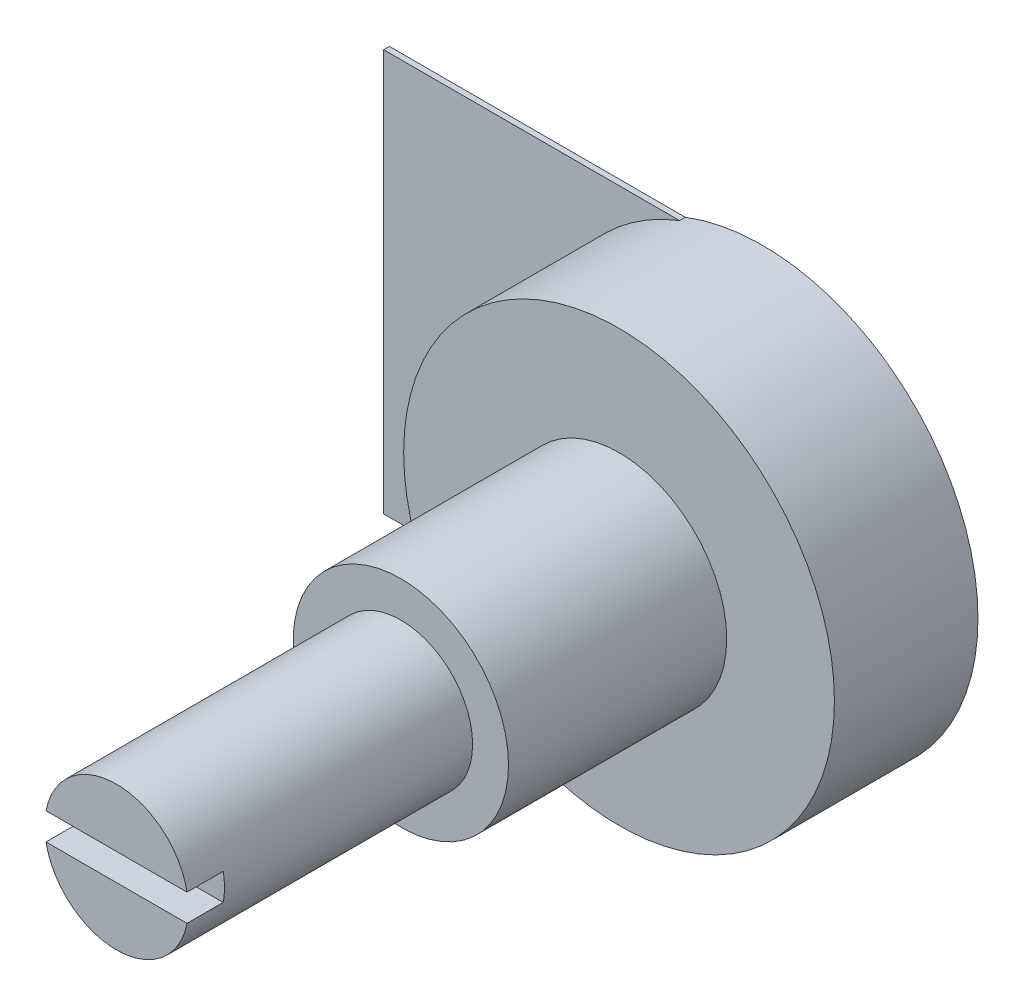
ISO-10303-21;
HEADER;
FILE_DESCRIPTION(('STEP AP214'),'2;1');
FILE_NAME('part.step','',(''),(''),'','','');
FILE_SCHEMA(('AUTOMOTIVE_DESIGN { 1 0 10303 214 1 1 1 1 }'));
ENDSEC;
DATA;
#1=APPLICATION_CONTEXT('core data for automotive mechanical design processes');
#2=APPLICATION_PROTOCOL_DEFINITION('international standard','automotive_design',2000,#1);
#3=PRODUCT_CONTEXT('',#1,'mechanical');
#4=PRODUCT('Part','Part','',(#3));
#5=PRODUCT_RELATED_PRODUCT_CATEGORY('part','',(#4));
#6=PRODUCT_DEFINITION_FORMATION('','',#4);
#7=PRODUCT_DEFINITION_CONTEXT('part definition',#1,'design');
#8=PRODUCT_DEFINITION('design','',#6,#7);
#9=PRODUCT_DEFINITION_SHAPE('','',#8);
#10=(LENGTH_UNIT() NAMED_UNIT(*) SI_UNIT(.MILLI.,.METRE.));
#11=(NAMED_UNIT(*) PLANE_ANGLE_UNIT() SI_UNIT($,.RADIAN.));
#12=(NAMED_UNIT(*) SI_UNIT($,.STERADIAN.) SOLID_ANGLE_UNIT());
#13=UNCERTAINTY_MEASURE_WITH_UNIT(LENGTH_MEASURE(1.E-05),#10,'distance_accuracy_value','');
#14=(GEOMETRIC_REPRESENTATION_CONTEXT(3) GLOBAL_UNCERTAINTY_ASSIGNED_CONTEXT((#13)) GLOBAL_UNIT_ASSIGNED_CONTEXT((#10,
#11,#12)) REPRESENTATION_CONTEXT('',''));
#15=CARTESIAN_POINT('',(0.,0.,0.));
#16=DIRECTION('',(0.,0.,1.));
#17=DIRECTION('',(1.,0.,0.));
#18=AXIS2_PLACEMENT_3D('',#15,#16,#17);
#19=CARTESIAN_POINT('',(-16.51,-8.89,0.));
#20=DIRECTION('',(0.,-1.,0.));
#21=DIRECTION('',(-1.,0.,0.));
#22=AXIS2_PLACEMENT_3D('',#19,#20,#21);
#23=PLANE('',#22);
#24=DIRECTION('',(0.,0.,-1.));
#25=VECTOR('',#24,1.);
#26=CARTESIAN_POINT('',(-3.41957965253042,-8.89,0.));
#27=LINE('',#26,#25);
#28=CARTESIAN_POINT('',(-3.41957965253042,-8.89,0.254));
#29=VERTEX_POINT('',#28);
#30=CARTESIAN_POINT('',(-3.41957965253042,-8.89,0.));
#31=VERTEX_POINT('',#30);
#32=EDGE_CURVE('E41',#29,#31,#27,.T.);
#33=ORIENTED_EDGE('',*,*,#32,.F.);
#34=DIRECTION('',(1.,0.,0.));
#35=VECTOR('',#34,1.);
#36=CARTESIAN_POINT('',(-3.41957965253042,-8.89,0.254));
#37=LINE('',#36,#35);
#38=CARTESIAN_POINT('',(-16.51,-8.89,0.254));
#39=VERTEX_POINT('',#38);
#40=EDGE_CURVE('E129',#39,#29,#37,.T.);
#41=ORIENTED_EDGE('',*,*,#40,.F.);
#42=DIRECTION('',(0.,0.,1.));
#43=VECTOR('',#42,1.);
#44=CARTESIAN_POINT('',(-16.51,-8.89,0.));
#45=LINE('',#44,#43);
#46=CARTESIAN_POINT('',(-16.51,-8.89,0.));
#47=VERTEX_POINT('',#46);
#48=EDGE_CURVE('E126',#47,#39,#45,.T.);
#49=ORIENTED_EDGE('',*,*,#48,.F.);
#50=DIRECTION('',(-1.,0.,0.));
#51=VECTOR('',#50,1.);
#52=CARTESIAN_POINT('',(0.,-8.89,0.));
#53=LINE('',#52,#51);
#54=EDGE_CURVE('E163',#31,#47,#53,.T.);
#55=ORIENTED_EDGE('',*,*,#54,.F.);
#56=EDGE_LOOP('',(#33,#41,#49,#55));
#57=FACE_BOUND('',#56,.T.);
#58=ADVANCED_FACE('F16',(#57),#23,.T.);
#59=CARTESIAN_POINT('',(-8.255,0.,0.254));
#60=DIRECTION('',(0.,0.,1.));
#61=DIRECTION('',(1.,0.,0.));
#62=AXIS2_PLACEMENT_3D('',#59,#60,#61);
#63=PLANE('',#62);
#64=CARTESIAN_POINT('',(0.,0.,0.254));
#65=DIRECTION('',(0.,0.,1.));
#66=DIRECTION('',(-1.,0.,0.));
#67=AXIS2_PLACEMENT_3D('',#64,#65,#66);
#68=CIRCLE('',#67,9.525);
#69=CARTESIAN_POINT('',(-3.41957965253042,8.89,0.254));
#70=VERTEX_POINT('',#69);
#71=EDGE_CURVE('E134',#70,#29,#68,.T.);
#72=ORIENTED_EDGE('',*,*,#71,.F.);
#73=DIRECTION('',(-1.,0.,0.));
#74=VECTOR('',#73,1.);
#75=CARTESIAN_POINT('',(-3.41957965253042,8.89,0.254));
#76=LINE('',#75,#74);
#77=CARTESIAN_POINT('',(-16.51,8.89,0.254));
#78=VERTEX_POINT('',#77);
#79=EDGE_CURVE('E10',#70,#78,#76,.T.);
#80=ORIENTED_EDGE('',*,*,#79,.T.);
#81=DIRECTION('',(0.,-1.,0.));
#82=VECTOR('',#81,1.);
#83=CARTESIAN_POINT('',(-16.51,-8.89,0.254));
#84=LINE('',#83,#82);
#85=EDGE_CURVE('E27',#78,#39,#84,.T.);
#86=ORIENTED_EDGE('',*,*,#85,.T.);
#87=ORIENTED_EDGE('',*,*,#40,.T.);
#88=EDGE_LOOP('',(#72,#80,#86,#87));
#89=FACE_BOUND('',#88,.T.);
#90=ADVANCED_FACE('F132',(#89),#63,.T.);
#91=CARTESIAN_POINT('',(0.,8.89,0.));
#92=DIRECTION('',(0.,1.,0.));
#93=DIRECTION('',(1.,0.,0.));
#94=AXIS2_PLACEMENT_3D('',#91,#92,#93);
#95=PLANE('',#94);
#96=DIRECTION('',(0.,0.,1.));
#97=VECTOR('',#96,1.);
#98=CARTESIAN_POINT('',(-3.41957965253042,8.89,0.));
#99=LINE('',#98,#97);
#100=CARTESIAN_POINT('',(-3.41957965253042,8.89,0.));
#101=VERTEX_POINT('',#100);
#102=EDGE_CURVE('E189',#101,#70,#99,.T.);
#103=ORIENTED_EDGE('',*,*,#102,.F.);
#104=DIRECTION('',(1.,0.,0.));
#105=VECTOR('',#104,1.);
#106=CARTESIAN_POINT('',(-16.51,8.89,0.));
#107=LINE('',#106,#105);
#108=CARTESIAN_POINT('',(-16.51,8.89,0.));
#109=VERTEX_POINT('',#108);
#110=EDGE_CURVE('E139',#109,#101,#107,.T.);
#111=ORIENTED_EDGE('',*,*,#110,.F.);
#112=DIRECTION('',(0.,0.,1.));
#113=VECTOR('',#112,1.);
#114=CARTESIAN_POINT('',(-16.51,8.89,0.));
#115=LINE('',#114,#113);
#116=EDGE_CURVE('E123',#109,#78,#115,.T.);
#117=ORIENTED_EDGE('',*,*,#116,.T.);
#118=ORIENTED_EDGE('',*,*,#79,.F.);
#119=EDGE_LOOP('',(#103,#111,#117,#118));
#120=FACE_BOUND('',#119,.T.);
#121=ADVANCED_FACE('F138',(#120),#95,.T.);
#122=CARTESIAN_POINT('',(-16.51,8.89,0.));
#123=DIRECTION('',(-1.,0.,0.));
#124=DIRECTION('',(0.,0.,1.));
#125=AXIS2_PLACEMENT_3D('',#122,#123,#124);
#126=PLANE('',#125);
#127=DIRECTION('',(0.,1.,0.));
#128=VECTOR('',#127,1.);
#129=CARTESIAN_POINT('',(-16.51,-8.89,0.));
#130=LINE('',#129,#128);
#131=EDGE_CURVE('E166',#47,#109,#130,.T.);
#132=ORIENTED_EDGE('',*,*,#131,.F.);
#133=ORIENTED_EDGE('',*,*,#48,.T.);
#134=ORIENTED_EDGE('',*,*,#85,.F.);
#135=ORIENTED_EDGE('',*,*,#116,.F.);
#136=EDGE_LOOP('',(#132,#133,#134,#135));
#137=FACE_BOUND('',#136,.T.);
#138=ADVANCED_FACE('F121',(#137),#126,.T.);
#139=CARTESIAN_POINT('',(0.,0.,26.9748));
#140=DIRECTION('',(0.,0.,-1.));
#141=DIRECTION('',(0.,-1.,0.));
#142=AXIS2_PLACEMENT_3D('',#139,#140,#141);
#143=PLANE('',#142);
#144=CARTESIAN_POINT('',(0.,0.,26.9748));
#145=DIRECTION('',(0.,0.,-1.));
#146=DIRECTION('',(-1.,0.,0.));
#147=AXIS2_PLACEMENT_3D('',#144,#145,#146);
#148=CIRCLE('',#147,3.175);
#149=CARTESIAN_POINT('',(-3.11838666460718,-0.5969,26.9748));
#150=VERTEX_POINT('',#149);
#151=CARTESIAN_POINT('',(-3.11838666460718,0.5969,26.9748));
#152=VERTEX_POINT('',#151);
#153=EDGE_CURVE('E174',#150,#152,#148,.T.);
#154=ORIENTED_EDGE('',*,*,#153,.F.);
#155=DIRECTION('',(-1.,0.,0.));
#156=VECTOR('',#155,1.);
#157=CARTESIAN_POINT('',(6.35,-0.5969,26.9748));
#158=LINE('',#157,#156);
#159=CARTESIAN_POINT('',(3.11838666460718,-0.5969,26.9748));
#160=VERTEX_POINT('',#159);
#161=EDGE_CURVE('E224',#160,#150,#158,.T.);
#162=ORIENTED_EDGE('',*,*,#161,.F.);
#163=CARTESIAN_POINT('',(0.,0.,26.9748));
#164=DIRECTION('',(0.,0.,-1.));
#165=DIRECTION('',(-1.,0.,0.));
#166=AXIS2_PLACEMENT_3D('',#163,#164,#165);
#167=CIRCLE('',#166,3.175);
#168=CARTESIAN_POINT('',(3.175,0.,26.9748));
#169=VERTEX_POINT('',#168);
#170=EDGE_CURVE('E179',#169,#160,#167,.T.);
#171=ORIENTED_EDGE('',*,*,#170,.F.);
#172=CARTESIAN_POINT('',(0.,0.,26.9748));
#173=DIRECTION('',(0.,0.,-1.));
#174=DIRECTION('',(-1.,0.,0.));
#175=AXIS2_PLACEMENT_3D('',#172,#173,#174);
#176=CIRCLE('',#175,3.175);
#177=CARTESIAN_POINT('',(3.11838666460718,0.5969,26.9748));
#178=VERTEX_POINT('',#177);
#179=EDGE_CURVE('E200',#178,#169,#176,.T.);
#180=ORIENTED_EDGE('',*,*,#179,.F.);
#181=DIRECTION('',(1.,0.,0.));
#182=VECTOR('',#181,1.);
#183=CARTESIAN_POINT('',(-6.35,0.5969,26.9748));
#184=LINE('',#183,#182);
#185=EDGE_CURVE('E148',#152,#178,#184,.T.);
#186=ORIENTED_EDGE('',*,*,#185,.F.);
#187=EDGE_LOOP('',(#154,#162,#171,#180,#186));
#188=FACE_BOUND('',#187,.T.);
#189=ADVANCED_FACE('F265',(#188),#143,.F.);
#190=CARTESIAN_POINT('',(-6.35,0.5969,28.575));
#191=DIRECTION('',(0.,1.,0.));
#192=DIRECTION('',(1.,0.,0.));
#193=AXIS2_PLACEMENT_3D('',#190,#191,#192);
#194=PLANE('',#193);
#195=DIRECTION('',(0.,0.,1.));
#196=VECTOR('',#195,1.);
#197=CARTESIAN_POINT('',(-3.11838666460718,0.5969,16.002));
#198=LINE('',#197,#196);
#199=CARTESIAN_POINT('',(-3.11838666460718,0.5969,28.575));
#200=VERTEX_POINT('',#199);
#201=EDGE_CURVE('E170',#152,#200,#198,.T.);
#202=ORIENTED_EDGE('',*,*,#201,.F.);
#203=ORIENTED_EDGE('',*,*,#185,.T.);
#204=DIRECTION('',(0.,0.,-1.));
#205=VECTOR('',#204,1.);
#206=CARTESIAN_POINT('',(3.11838666460718,0.5969,16.002));
#207=LINE('',#206,#205);
#208=CARTESIAN_POINT('',(3.11838666460718,0.5969,28.575));
#209=VERTEX_POINT('',#208);
#210=EDGE_CURVE('E175',#209,#178,#207,.T.);
#211=ORIENTED_EDGE('',*,*,#210,.F.);
#212=DIRECTION('',(1.,0.,0.));
#213=VECTOR('',#212,1.);
#214=CARTESIAN_POINT('',(-3.175,0.5969,28.575));
#215=LINE('',#214,#213);
#216=EDGE_CURVE('E156',#200,#209,#215,.T.);
#217=ORIENTED_EDGE('',*,*,#216,.F.);
#218=EDGE_LOOP('',(#202,#203,#211,#217));
#219=FACE_BOUND('',#218,.T.);
#220=ADVANCED_FACE('F268',(#219),#194,.F.);
#221=CARTESIAN_POINT('',(6.35,-0.5969,28.575));
#222=DIRECTION('',(0.,-1.,0.));
#223=DIRECTION('',(0.,0.,-1.));
#224=AXIS2_PLACEMENT_3D('',#221,#222,#223);
#225=PLANE('',#224);
#226=DIRECTION('',(0.,0.,-1.));
#227=VECTOR('',#226,1.);
#228=CARTESIAN_POINT('',(-3.11838666460718,-0.5969,16.002));
#229=LINE('',#228,#227);
#230=CARTESIAN_POINT('',(-3.11838666460718,-0.5969,28.575));
#231=VERTEX_POINT('',#230);
#232=EDGE_CURVE('E188',#231,#150,#229,.T.);
#233=ORIENTED_EDGE('',*,*,#232,.F.);
#234=DIRECTION('',(-1.,0.,0.));
#235=VECTOR('',#234,1.);
#236=CARTESIAN_POINT('',(3.175,-0.5969,28.575));
#237=LINE('',#236,#235);
#238=CARTESIAN_POINT('',(3.11838666460718,-0.5969,28.575));
#239=VERTEX_POINT('',#238);
#240=EDGE_CURVE('E157',#239,#231,#237,.T.);
#241=ORIENTED_EDGE('',*,*,#240,.F.);
#242=DIRECTION('',(0.,0.,1.));
#243=VECTOR('',#242,1.);
#244=CARTESIAN_POINT('',(3.11838666460718,-0.5969,16.002));
#245=LINE('',#244,#243);
#246=EDGE_CURVE('E162',#160,#239,#245,.T.);
#247=ORIENTED_EDGE('',*,*,#246,.F.);
#248=ORIENTED_EDGE('',*,*,#161,.T.);
#249=EDGE_LOOP('',(#233,#241,#247,#248));
#250=FACE_BOUND('',#249,.T.);
#251=ADVANCED_FACE('F274',(#250),#225,.F.);
#252=CARTESIAN_POINT('',(0.,0.,28.575));
#253=DIRECTION('',(0.,0.,1.));
#254=DIRECTION('',(1.,0.,0.));
#255=AXIS2_PLACEMENT_3D('',#252,#253,#254);
#256=PLANE('',#255);
#257=ORIENTED_EDGE('',*,*,#216,.T.);
#258=CARTESIAN_POINT('',(0.,0.,28.575));
#259=DIRECTION('',(0.,0.,1.));
#260=DIRECTION('',(-1.,0.,0.));
#261=AXIS2_PLACEMENT_3D('',#258,#259,#260);
#262=CIRCLE('',#261,3.175);
#263=EDGE_CURVE('E152',#209,#200,#262,.T.);
#264=ORIENTED_EDGE('',*,*,#263,.T.);
#265=EDGE_LOOP('',(#257,#264));
#266=FACE_BOUND('',#265,.T.);
#267=ADVANCED_FACE('F272',(#266),#256,.T.);
#268=CARTESIAN_POINT('',(0.,0.,28.575));
#269=DIRECTION('',(0.,0.,1.));
#270=DIRECTION('',(1.,0.,0.));
#271=AXIS2_PLACEMENT_3D('',#268,#269,#270);
#272=PLANE('',#271);
#273=ORIENTED_EDGE('',*,*,#240,.T.);
#274=CARTESIAN_POINT('',(0.,0.,28.575));
#275=DIRECTION('',(0.,0.,1.));
#276=DIRECTION('',(-1.,0.,0.));
#277=AXIS2_PLACEMENT_3D('',#274,#275,#276);
#278=CIRCLE('',#277,3.175);
#279=EDGE_CURVE('E158',#231,#239,#278,.T.);
#280=ORIENTED_EDGE('',*,*,#279,.T.);
#281=EDGE_LOOP('',(#273,#280));
#282=FACE_BOUND('',#281,.T.);
#283=ADVANCED_FACE('F18',(#282),#272,.T.);
#284=CARTESIAN_POINT('',(0.,0.,16.002));
#285=DIRECTION('',(0.,0.,1.));
#286=DIRECTION('',(-1.,0.,0.));
#287=AXIS2_PLACEMENT_3D('',#284,#285,#286);
#288=CYLINDRICAL_SURFACE('',#287,3.175);
#289=ORIENTED_EDGE('',*,*,#246,.T.);
#290=ORIENTED_EDGE('',*,*,#279,.F.);
#291=ORIENTED_EDGE('',*,*,#232,.T.);
#292=ORIENTED_EDGE('',*,*,#153,.T.);
#293=ORIENTED_EDGE('',*,*,#201,.T.);
#294=ORIENTED_EDGE('',*,*,#263,.F.);
#295=ORIENTED_EDGE('',*,*,#210,.T.);
#296=ORIENTED_EDGE('',*,*,#179,.T.);
#297=DIRECTION('',(0.,0.,-1.));
#298=VECTOR('',#297,1.);
#299=CARTESIAN_POINT('',(3.175,0.,16.002));
#300=LINE('',#299,#298);
#301=CARTESIAN_POINT('',(3.175,0.,16.002));
#302=VERTEX_POINT('',#301);
#303=EDGE_CURVE('E183',#169,#302,#300,.T.);
#304=ORIENTED_EDGE('',*,*,#303,.T.);
#305=CARTESIAN_POINT('',(0.,0.,16.002));
#306=DIRECTION('',(0.,0.,-1.));
#307=DIRECTION('',(-1.,0.,0.));
#308=AXIS2_PLACEMENT_3D('',#305,#306,#307);
#309=CIRCLE('',#308,3.175);
#310=EDGE_CURVE('E199',#302,#302,#309,.T.);
#311=ORIENTED_EDGE('',*,*,#310,.F.);
#312=ORIENTED_EDGE('',*,*,#303,.F.);
#313=ORIENTED_EDGE('',*,*,#170,.T.);
#314=EDGE_LOOP('',(#289,#290,#291,#292,#293,#294,#295,#296,#304,#311,#312,#313));
#315=FACE_BOUND('',#314,.T.);
#316=ADVANCED_FACE('F257',(#315),#288,.T.);
#317=CARTESIAN_POINT('',(0.,0.,6.35));
#318=DIRECTION('',(0.,0.,1.));
#319=DIRECTION('',(-1.,0.,0.));
#320=AXIS2_PLACEMENT_3D('',#317,#318,#319);
#321=CYLINDRICAL_SURFACE('',#320,4.7625);
#322=CARTESIAN_POINT('',(0.,0.,16.002));
#323=DIRECTION('',(0.,0.,1.));
#324=DIRECTION('',(-1.,0.,0.));
#325=AXIS2_PLACEMENT_3D('',#322,#323,#324);
#326=CIRCLE('',#325,4.7625);
#327=CARTESIAN_POINT('',(4.7625,0.,16.002));
#328=VERTEX_POINT('',#327);
#329=EDGE_CURVE('E234',#328,#328,#326,.T.);
#330=ORIENTED_EDGE('',*,*,#329,.F.);
#331=DIRECTION('',(0.,0.,-1.));
#332=VECTOR('',#331,1.);
#333=CARTESIAN_POINT('',(4.7625,0.,6.35));
#334=LINE('',#333,#332);
#335=CARTESIAN_POINT('',(4.7625,0.,6.35));
#336=VERTEX_POINT('',#335);
#337=EDGE_CURVE('E184',#328,#336,#334,.T.);
#338=ORIENTED_EDGE('',*,*,#337,.T.);
#339=CARTESIAN_POINT('',(0.,0.,6.35));
#340=DIRECTION('',(0.,0.,-1.));
#341=DIRECTION('',(-1.,0.,0.));
#342=AXIS2_PLACEMENT_3D('',#339,#340,#341);
#343=CIRCLE('',#342,4.7625);
#344=EDGE_CURVE('E219',#336,#336,#343,.T.);
#345=ORIENTED_EDGE('',*,*,#344,.F.);
#346=ORIENTED_EDGE('',*,*,#337,.F.);
#347=EDGE_LOOP('',(#330,#338,#345,#346));
#348=FACE_BOUND('',#347,.T.);
#349=ADVANCED_FACE('F296',(#348),#321,.T.);
#350=CARTESIAN_POINT('',(0.,0.,16.002));
#351=DIRECTION('',(0.,0.,1.));
#352=DIRECTION('',(1.,0.,0.));
#353=AXIS2_PLACEMENT_3D('',#350,#351,#352);
#354=PLANE('',#353);
#355=ORIENTED_EDGE('',*,*,#329,.T.);
#356=EDGE_LOOP('',(#355));
#357=FACE_BOUND('',#356,.T.);
#358=ORIENTED_EDGE('',*,*,#310,.T.);
#359=EDGE_LOOP('',(#358));
#360=FACE_BOUND('',#359,.T.);
#361=ADVANCED_FACE('F299',(#357,#360),#354,.T.);
#362=CARTESIAN_POINT('',(0.,0.,0.));
#363=DIRECTION('',(0.,0.,1.));
#364=DIRECTION('',(-1.,0.,0.));
#365=AXIS2_PLACEMENT_3D('',#362,#363,#364);
#366=CYLINDRICAL_SURFACE('',#365,9.525);
#367=CARTESIAN_POINT('',(0.,0.,6.35));
#368=DIRECTION('',(0.,0.,1.));
#369=DIRECTION('',(-1.,0.,0.));
#370=AXIS2_PLACEMENT_3D('',#367,#368,#369);
#371=CIRCLE('',#370,9.525);
#372=CARTESIAN_POINT('',(9.525,0.,6.35));
#373=VERTEX_POINT('',#372);
#374=EDGE_CURVE('E223',#373,#373,#371,.T.);
#375=ORIENTED_EDGE('',*,*,#374,.F.);
#376=DIRECTION('',(0.,0.,-1.));
#377=VECTOR('',#376,1.);
#378=CARTESIAN_POINT('',(9.525,0.,0.));
#379=LINE('',#378,#377);
#380=CARTESIAN_POINT('',(9.525,0.,0.));
#381=VERTEX_POINT('',#380);
#382=EDGE_CURVE('E192',#373,#381,#379,.T.);
#383=ORIENTED_EDGE('',*,*,#382,.T.);
#384=CARTESIAN_POINT('',(0.,0.,0.));
#385=DIRECTION('',(0.,0.,-1.));
#386=DIRECTION('',(-1.,0.,0.));
#387=AXIS2_PLACEMENT_3D('',#384,#385,#386);
#388=CIRCLE('',#387,9.525);
#389=EDGE_CURVE('E167',#101,#381,#388,.T.);
#390=ORIENTED_EDGE('',*,*,#389,.F.);
#391=ORIENTED_EDGE('',*,*,#102,.T.);
#392=ORIENTED_EDGE('',*,*,#71,.T.);
#393=ORIENTED_EDGE('',*,*,#32,.T.);
#394=CARTESIAN_POINT('',(0.,0.,0.));
#395=DIRECTION('',(0.,0.,-1.));
#396=DIRECTION('',(-1.,0.,0.));
#397=AXIS2_PLACEMENT_3D('',#394,#395,#396);
#398=CIRCLE('',#397,9.525);
#399=EDGE_CURVE('E20',#381,#31,#398,.T.);
#400=ORIENTED_EDGE('',*,*,#399,.F.);
#401=ORIENTED_EDGE('',*,*,#382,.F.);
#402=EDGE_LOOP('',(#375,#383,#390,#391,#392,#393,#400,#401));
#403=FACE_BOUND('',#402,.T.);
#404=ADVANCED_FACE('F301',(#403),#366,.T.);
#405=CARTESIAN_POINT('',(0.,0.,0.));
#406=DIRECTION('',(0.,0.,1.));
#407=DIRECTION('',(1.,0.,0.));
#408=AXIS2_PLACEMENT_3D('',#405,#406,#407);
#409=PLANE('',#408);
#410=ORIENTED_EDGE('',*,*,#389,.T.);
#411=ORIENTED_EDGE('',*,*,#399,.T.);
#412=ORIENTED_EDGE('',*,*,#54,.T.);
#413=ORIENTED_EDGE('',*,*,#131,.T.);
#414=ORIENTED_EDGE('',*,*,#110,.T.);
#415=EDGE_LOOP('',(#410,#411,#412,#413,#414));
#416=FACE_BOUND('',#415,.T.);
#417=ADVANCED_FACE('F303',(#416),#409,.F.);
#418=CARTESIAN_POINT('',(0.,0.,6.35));
#419=DIRECTION('',(0.,0.,1.));
#420=DIRECTION('',(1.,0.,0.));
#421=AXIS2_PLACEMENT_3D('',#418,#419,#420);
#422=PLANE('',#421);
#423=ORIENTED_EDGE('',*,*,#374,.T.);
#424=EDGE_LOOP('',(#423));
#425=FACE_BOUND('',#424,.T.);
#426=ORIENTED_EDGE('',*,*,#344,.T.);
#427=EDGE_LOOP('',(#426));
#428=FACE_BOUND('',#427,.T.);
#429=ADVANCED_FACE('F317',(#425,#428),#422,.T.);
#430=CLOSED_SHELL('',(#58,#90,#121,#138,#189,#220,#251,#267,#283,#316,#349,#361,#404,#417,#429));
#431=MANIFOLD_SOLID_BREP('B1',#430);
#432=ADVANCED_BREP_SHAPE_REPRESENTATION('',(#18,#431),#14);
#433=SHAPE_DEFINITION_REPRESENTATION(#9,#432);
ENDSEC;
END-ISO-10303-21;
